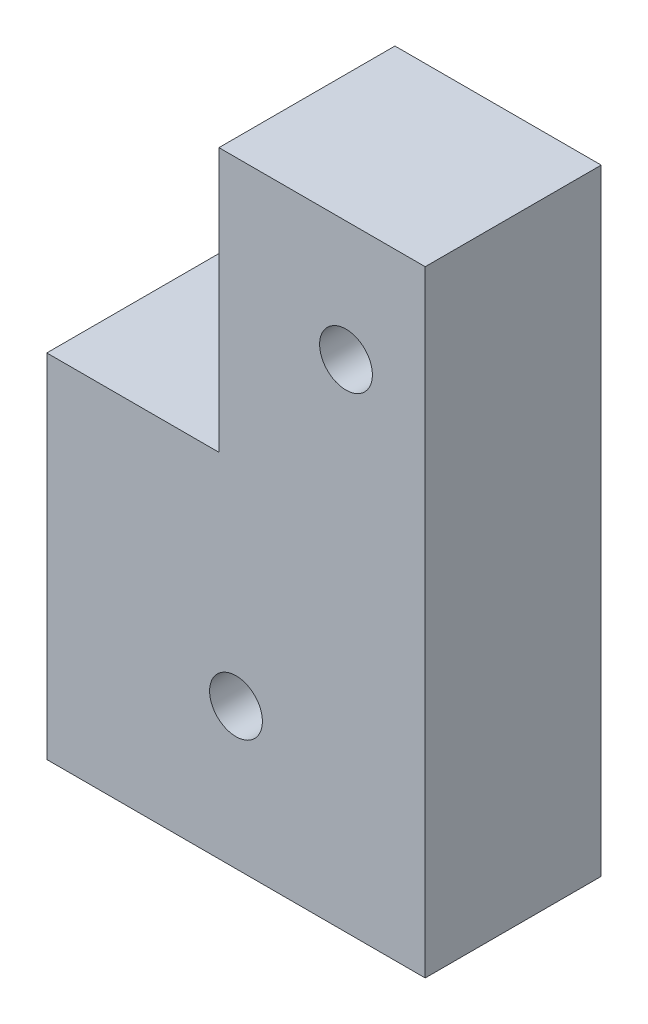
ISO-10303-21;
HEADER;
FILE_DESCRIPTION(('STEP AP214'),'2;1');
FILE_NAME('part.step','',(''),(''),'','','');
FILE_SCHEMA(('AUTOMOTIVE_DESIGN { 1 0 10303 214 1 1 1 1 }'));
ENDSEC;
DATA;
#1=APPLICATION_CONTEXT('core data for automotive mechanical design processes');
#2=APPLICATION_PROTOCOL_DEFINITION('international standard','automotive_design',2000,#1);
#3=PRODUCT_CONTEXT('',#1,'mechanical');
#4=PRODUCT('Part','Part','',(#3));
#5=PRODUCT_RELATED_PRODUCT_CATEGORY('part','',(#4));
#6=PRODUCT_DEFINITION_FORMATION('','',#4);
#7=PRODUCT_DEFINITION_CONTEXT('part definition',#1,'design');
#8=PRODUCT_DEFINITION('design','',#6,#7);
#9=PRODUCT_DEFINITION_SHAPE('','',#8);
#10=(LENGTH_UNIT() NAMED_UNIT(*) SI_UNIT(.MILLI.,.METRE.));
#11=(NAMED_UNIT(*) PLANE_ANGLE_UNIT() SI_UNIT($,.RADIAN.));
#12=(NAMED_UNIT(*) SI_UNIT($,.STERADIAN.) SOLID_ANGLE_UNIT());
#13=UNCERTAINTY_MEASURE_WITH_UNIT(LENGTH_MEASURE(1.E-05),#10,'distance_accuracy_value','');
#14=(GEOMETRIC_REPRESENTATION_CONTEXT(3) GLOBAL_UNCERTAINTY_ASSIGNED_CONTEXT((#13)) GLOBAL_UNIT_ASSIGNED_CONTEXT((#10,
#11,#12)) REPRESENTATION_CONTEXT('',''));
#15=CARTESIAN_POINT('',(0.,0.,0.));
#16=DIRECTION('',(0.,0.,1.));
#17=DIRECTION('',(1.,0.,0.));
#18=AXIS2_PLACEMENT_3D('',#15,#16,#17);
#19=CARTESIAN_POINT('',(26.9541626692868,20.7752143335022,10.));
#20=DIRECTION('',(-1.,0.,0.));
#21=DIRECTION('',(0.,0.,1.));
#22=AXIS2_PLACEMENT_3D('',#19,#20,#21);
#23=PLANE('',#22);
#24=DIRECTION('',(0.,0.,-1.));
#25=VECTOR('',#24,1.);
#26=CARTESIAN_POINT('',(26.9541626692868,17.5952143335022,10.));
#27=LINE('',#26,#25);
#28=CARTESIAN_POINT('',(26.9541626692868,17.5952143335022,10.));
#29=VERTEX_POINT('',#28);
#30=CARTESIAN_POINT('',(26.9541626692868,17.5952143335022,0.));
#31=VERTEX_POINT('',#30);
#32=EDGE_CURVE('E94',#29,#31,#27,.T.);
#33=ORIENTED_EDGE('',*,*,#32,.F.);
#34=DIRECTION('',(0.,1.,0.));
#35=VECTOR('',#34,1.);
#36=CARTESIAN_POINT('',(26.9541626692868,20.7752143335022,10.));
#37=LINE('',#36,#35);
#38=CARTESIAN_POINT('',(26.9541626692868,-17.4039243515053,10.));
#39=VERTEX_POINT('',#38);
#40=EDGE_CURVE('E127',#39,#29,#37,.T.);
#41=ORIENTED_EDGE('',*,*,#40,.F.);
#42=DIRECTION('',(0.,0.,-1.));
#43=VECTOR('',#42,1.);
#44=CARTESIAN_POINT('',(26.9541626692868,-17.4039243515053,10.));
#45=LINE('',#44,#43);
#46=CARTESIAN_POINT('',(26.9541626692868,-17.4039243515053,0.));
#47=VERTEX_POINT('',#46);
#48=EDGE_CURVE('E50',#39,#47,#45,.T.);
#49=ORIENTED_EDGE('',*,*,#48,.T.);
#50=DIRECTION('',(0.,1.,0.));
#51=VECTOR('',#50,1.);
#52=CARTESIAN_POINT('',(26.9541626692868,20.7752143335022,0.));
#53=LINE('',#52,#51);
#54=EDGE_CURVE('E108',#47,#31,#53,.T.);
#55=ORIENTED_EDGE('',*,*,#54,.T.);
#56=EDGE_LOOP('',(#33,#41,#49,#55));
#57=FACE_BOUND('',#56,.T.);
#58=ADVANCED_FACE('F41',(#57),#23,.F.);
#59=CARTESIAN_POINT('',(0.,0.,10.));
#60=DIRECTION('',(0.,0.,1.));
#61=DIRECTION('',(1.,0.,0.));
#62=AXIS2_PLACEMENT_3D('',#59,#60,#61);
#63=PLANE('',#62);
#64=CARTESIAN_POINT('',(16.2041626692868,-9.40392435150529,10.));
#65=DIRECTION('',(0.,0.,1.));
#66=DIRECTION('',(1.,0.,0.));
#67=AXIS2_PLACEMENT_3D('',#64,#65,#66);
#68=CIRCLE('',#67,1.5);
#69=CARTESIAN_POINT('',(17.7041626692868,-9.40392435150529,10.));
#70=VERTEX_POINT('',#69);
#71=EDGE_CURVE('E168',#70,#70,#68,.T.);
#72=ORIENTED_EDGE('',*,*,#71,.F.);
#73=EDGE_LOOP('',(#72));
#74=FACE_BOUND('',#73,.T.);
#75=CARTESIAN_POINT('',(22.4541626692868,10.7752143335022,10.));
#76=DIRECTION('',(0.,0.,1.));
#77=DIRECTION('',(1.,0.,0.));
#78=AXIS2_PLACEMENT_3D('',#75,#76,#77);
#79=CIRCLE('',#78,1.5);
#80=CARTESIAN_POINT('',(23.9541626692868,10.7752143335022,10.));
#81=VERTEX_POINT('',#80);
#82=EDGE_CURVE('E160',#81,#81,#79,.T.);
#83=ORIENTED_EDGE('',*,*,#82,.F.);
#84=EDGE_LOOP('',(#83));
#85=FACE_BOUND('',#84,.T.);
#86=ORIENTED_EDGE('',*,*,#40,.T.);
#87=DIRECTION('',(1.,0.,0.));
#88=VECTOR('',#87,1.);
#89=CARTESIAN_POINT('',(15.2349516875641,17.5952143335022,10.));
#90=LINE('',#89,#88);
#91=CARTESIAN_POINT('',(15.2349516875641,17.5952143335022,10.));
#92=VERTEX_POINT('',#91);
#93=EDGE_CURVE('E97',#92,#29,#90,.T.);
#94=ORIENTED_EDGE('',*,*,#93,.F.);
#95=DIRECTION('',(0.,1.,0.));
#96=VECTOR('',#95,1.);
#97=CARTESIAN_POINT('',(15.2349516875641,2.6034512529472,10.));
#98=LINE('',#97,#96);
#99=CARTESIAN_POINT('',(15.2349516875641,2.6034512529472,10.));
#100=VERTEX_POINT('',#99);
#101=EDGE_CURVE('E150',#100,#92,#98,.T.);
#102=ORIENTED_EDGE('',*,*,#101,.F.);
#103=DIRECTION('',(1.,0.,0.));
#104=VECTOR('',#103,1.);
#105=CARTESIAN_POINT('',(5.45416266928679,2.6034512529472,10.));
#106=LINE('',#105,#104);
#107=CARTESIAN_POINT('',(5.45416266928679,2.6034512529472,10.));
#108=VERTEX_POINT('',#107);
#109=EDGE_CURVE('E134',#108,#100,#106,.T.);
#110=ORIENTED_EDGE('',*,*,#109,.F.);
#111=DIRECTION('',(0.,-1.,0.));
#112=VECTOR('',#111,1.);
#113=CARTESIAN_POINT('',(5.45416266928679,8.6034512529472,10.));
#114=LINE('',#113,#112);
#115=CARTESIAN_POINT('',(5.45416266928679,-17.4039243515053,10.));
#116=VERTEX_POINT('',#115);
#117=EDGE_CURVE('E116',#108,#116,#114,.T.);
#118=ORIENTED_EDGE('',*,*,#117,.T.);
#119=DIRECTION('',(1.,0.,0.));
#120=VECTOR('',#119,1.);
#121=CARTESIAN_POINT('',(5.45416266928679,-17.4039243515053,10.));
#122=LINE('',#121,#120);
#123=EDGE_CURVE('E121',#116,#39,#122,.T.);
#124=ORIENTED_EDGE('',*,*,#123,.T.);
#125=EDGE_LOOP('',(#86,#94,#102,#110,#118,#124));
#126=FACE_BOUND('',#125,.T.);
#127=ADVANCED_FACE('F179',(#74,#85,#126),#63,.T.);
#128=CARTESIAN_POINT('',(0.,0.,0.));
#129=DIRECTION('',(0.,0.,1.));
#130=DIRECTION('',(1.,0.,0.));
#131=AXIS2_PLACEMENT_3D('',#128,#129,#130);
#132=PLANE('',#131);
#133=CARTESIAN_POINT('',(22.4541626692868,10.7752143335022,0.));
#134=DIRECTION('',(0.,0.,1.));
#135=DIRECTION('',(1.,0.,0.));
#136=AXIS2_PLACEMENT_3D('',#133,#134,#135);
#137=CIRCLE('',#136,1.5);
#138=CARTESIAN_POINT('',(23.9541626692868,10.7752143335022,0.));
#139=VERTEX_POINT('',#138);
#140=EDGE_CURVE('E164',#139,#139,#137,.T.);
#141=ORIENTED_EDGE('',*,*,#140,.T.);
#142=EDGE_LOOP('',(#141));
#143=FACE_BOUND('',#142,.T.);
#144=CARTESIAN_POINT('',(16.2041626692868,-9.40392435150529,0.));
#145=DIRECTION('',(0.,0.,1.));
#146=DIRECTION('',(1.,0.,0.));
#147=AXIS2_PLACEMENT_3D('',#144,#145,#146);
#148=CIRCLE('',#147,1.5);
#149=CARTESIAN_POINT('',(17.7041626692868,-9.40392435150529,0.));
#150=VERTEX_POINT('',#149);
#151=EDGE_CURVE('E159',#150,#150,#148,.T.);
#152=ORIENTED_EDGE('',*,*,#151,.T.);
#153=EDGE_LOOP('',(#152));
#154=FACE_BOUND('',#153,.T.);
#155=DIRECTION('',(-1.,0.,0.));
#156=VECTOR('',#155,1.);
#157=CARTESIAN_POINT('',(26.9541626692868,17.5952143335022,0.));
#158=LINE('',#157,#156);
#159=CARTESIAN_POINT('',(15.2349516875641,17.5952143335022,0.));
#160=VERTEX_POINT('',#159);
#161=EDGE_CURVE('E57',#31,#160,#158,.T.);
#162=ORIENTED_EDGE('',*,*,#161,.F.);
#163=ORIENTED_EDGE('',*,*,#54,.F.);
#164=DIRECTION('',(1.,0.,0.));
#165=VECTOR('',#164,1.);
#166=CARTESIAN_POINT('',(5.45416266928679,-17.4039243515053,0.));
#167=LINE('',#166,#165);
#168=CARTESIAN_POINT('',(5.45416266928679,-17.4039243515053,0.));
#169=VERTEX_POINT('',#168);
#170=EDGE_CURVE('E117',#169,#47,#167,.T.);
#171=ORIENTED_EDGE('',*,*,#170,.F.);
#172=DIRECTION('',(0.,-1.,0.));
#173=VECTOR('',#172,1.);
#174=CARTESIAN_POINT('',(5.45416266928679,8.6034512529472,0.));
#175=LINE('',#174,#173);
#176=CARTESIAN_POINT('',(5.45416266928679,2.6034512529472,0.));
#177=VERTEX_POINT('',#176);
#178=EDGE_CURVE('E123',#177,#169,#175,.T.);
#179=ORIENTED_EDGE('',*,*,#178,.F.);
#180=DIRECTION('',(-1.,0.,0.));
#181=VECTOR('',#180,1.);
#182=CARTESIAN_POINT('',(16.2349516875641,2.6034512529472,0.));
#183=LINE('',#182,#181);
#184=CARTESIAN_POINT('',(15.2349516875641,2.6034512529472,0.));
#185=VERTEX_POINT('',#184);
#186=EDGE_CURVE('E145',#185,#177,#183,.T.);
#187=ORIENTED_EDGE('',*,*,#186,.F.);
#188=DIRECTION('',(0.,-1.,0.));
#189=VECTOR('',#188,1.);
#190=CARTESIAN_POINT('',(15.2349516875641,20.7752143335022,0.));
#191=LINE('',#190,#189);
#192=EDGE_CURVE('E64',#160,#185,#191,.T.);
#193=ORIENTED_EDGE('',*,*,#192,.F.);
#194=EDGE_LOOP('',(#162,#163,#171,#179,#187,#193));
#195=FACE_BOUND('',#194,.T.);
#196=ADVANCED_FACE('F106',(#143,#154,#195),#132,.F.);
#197=CARTESIAN_POINT('',(15.2349516875641,0.,0.));
#198=DIRECTION('',(-1.,0.,0.));
#199=DIRECTION('',(0.,0.,1.));
#200=AXIS2_PLACEMENT_3D('',#197,#198,#199);
#201=PLANE('',#200);
#202=ORIENTED_EDGE('',*,*,#101,.T.);
#203=DIRECTION('',(0.,0.,1.));
#204=VECTOR('',#203,1.);
#205=CARTESIAN_POINT('',(15.2349516875641,17.5952143335022,0.));
#206=LINE('',#205,#204);
#207=EDGE_CURVE('E111',#160,#92,#206,.T.);
#208=ORIENTED_EDGE('',*,*,#207,.F.);
#209=ORIENTED_EDGE('',*,*,#192,.T.);
#210=DIRECTION('',(0.,0.,1.));
#211=VECTOR('',#210,1.);
#212=CARTESIAN_POINT('',(15.2349516875641,2.6034512529472,0.));
#213=LINE('',#212,#211);
#214=EDGE_CURVE('E154',#185,#100,#213,.T.);
#215=ORIENTED_EDGE('',*,*,#214,.T.);
#216=EDGE_LOOP('',(#202,#208,#209,#215));
#217=FACE_BOUND('',#216,.T.);
#218=ADVANCED_FACE('F180',(#217),#201,.T.);
#219=CARTESIAN_POINT('',(5.45416266928679,8.6034512529472,10.));
#220=DIRECTION('',(1.,0.,0.));
#221=DIRECTION('',(0.,0.,-1.));
#222=AXIS2_PLACEMENT_3D('',#219,#220,#221);
#223=PLANE('',#222);
#224=DIRECTION('',(0.,0.,1.));
#225=VECTOR('',#224,1.);
#226=CARTESIAN_POINT('',(5.45416266928679,2.6034512529472,0.));
#227=LINE('',#226,#225);
#228=EDGE_CURVE('E140',#177,#108,#227,.T.);
#229=ORIENTED_EDGE('',*,*,#228,.F.);
#230=ORIENTED_EDGE('',*,*,#178,.T.);
#231=DIRECTION('',(0.,0.,-1.));
#232=VECTOR('',#231,1.);
#233=CARTESIAN_POINT('',(5.45416266928679,-17.4039243515053,10.));
#234=LINE('',#233,#232);
#235=EDGE_CURVE('E11',#116,#169,#234,.T.);
#236=ORIENTED_EDGE('',*,*,#235,.F.);
#237=ORIENTED_EDGE('',*,*,#117,.F.);
#238=EDGE_LOOP('',(#229,#230,#236,#237));
#239=FACE_BOUND('',#238,.T.);
#240=ADVANCED_FACE('F43',(#239),#223,.F.);
#241=CARTESIAN_POINT('',(5.45416266928679,-17.4039243515053,10.));
#242=DIRECTION('',(0.,1.,0.));
#243=DIRECTION('',(-1.,0.,0.));
#244=AXIS2_PLACEMENT_3D('',#241,#242,#243);
#245=PLANE('',#244);
#246=ORIENTED_EDGE('',*,*,#170,.T.);
#247=ORIENTED_EDGE('',*,*,#48,.F.);
#248=ORIENTED_EDGE('',*,*,#123,.F.);
#249=ORIENTED_EDGE('',*,*,#235,.T.);
#250=EDGE_LOOP('',(#246,#247,#248,#249));
#251=FACE_BOUND('',#250,.T.);
#252=ADVANCED_FACE('F183',(#251),#245,.F.);
#253=CARTESIAN_POINT('',(0.,2.6034512529472,0.));
#254=DIRECTION('',(0.,1.,0.));
#255=DIRECTION('',(0.,0.,1.));
#256=AXIS2_PLACEMENT_3D('',#253,#254,#255);
#257=PLANE('',#256);
#258=ORIENTED_EDGE('',*,*,#214,.F.);
#259=ORIENTED_EDGE('',*,*,#186,.T.);
#260=ORIENTED_EDGE('',*,*,#228,.T.);
#261=ORIENTED_EDGE('',*,*,#109,.T.);
#262=EDGE_LOOP('',(#258,#259,#260,#261));
#263=FACE_BOUND('',#262,.T.);
#264=ADVANCED_FACE('F181',(#263),#257,.T.);
#265=CARTESIAN_POINT('',(22.4541626692868,10.7752143335022,0.));
#266=DIRECTION('',(0.,0.,1.));
#267=DIRECTION('',(1.,0.,0.));
#268=AXIS2_PLACEMENT_3D('',#265,#266,#267);
#269=CYLINDRICAL_SURFACE('',#268,1.5);
#270=ORIENTED_EDGE('',*,*,#140,.F.);
#271=EDGE_LOOP('',(#270));
#272=FACE_BOUND('',#271,.T.);
#273=ORIENTED_EDGE('',*,*,#82,.T.);
#274=EDGE_LOOP('',(#273));
#275=FACE_BOUND('',#274,.T.);
#276=ADVANCED_FACE('F208',(#272,#275),#269,.F.);
#277=CARTESIAN_POINT('',(16.2041626692868,-9.40392435150529,0.));
#278=DIRECTION('',(0.,0.,1.));
#279=DIRECTION('',(1.,0.,0.));
#280=AXIS2_PLACEMENT_3D('',#277,#278,#279);
#281=CYLINDRICAL_SURFACE('',#280,1.5);
#282=ORIENTED_EDGE('',*,*,#151,.F.);
#283=EDGE_LOOP('',(#282));
#284=FACE_BOUND('',#283,.T.);
#285=ORIENTED_EDGE('',*,*,#71,.T.);
#286=EDGE_LOOP('',(#285));
#287=FACE_BOUND('',#286,.T.);
#288=ADVANCED_FACE('F212',(#284,#287),#281,.F.);
#289=CARTESIAN_POINT('',(0.,17.5952143335022,0.));
#290=DIRECTION('',(0.,1.,0.));
#291=DIRECTION('',(0.,0.,1.));
#292=AXIS2_PLACEMENT_3D('',#289,#290,#291);
#293=PLANE('',#292);
#294=ORIENTED_EDGE('',*,*,#32,.T.);
#295=ORIENTED_EDGE('',*,*,#161,.T.);
#296=ORIENTED_EDGE('',*,*,#207,.T.);
#297=ORIENTED_EDGE('',*,*,#93,.T.);
#298=EDGE_LOOP('',(#294,#295,#296,#297));
#299=FACE_BOUND('',#298,.T.);
#300=ADVANCED_FACE('F95',(#299),#293,.T.);
#301=CLOSED_SHELL('',(#58,#127,#196,#218,#240,#252,#264,#276,#288,#300));
#302=MANIFOLD_SOLID_BREP('B2',#301);
#303=ADVANCED_BREP_SHAPE_REPRESENTATION('',(#18,#302),#14);
#304=SHAPE_DEFINITION_REPRESENTATION(#9,#303);
ENDSEC;
END-ISO-10303-21;
